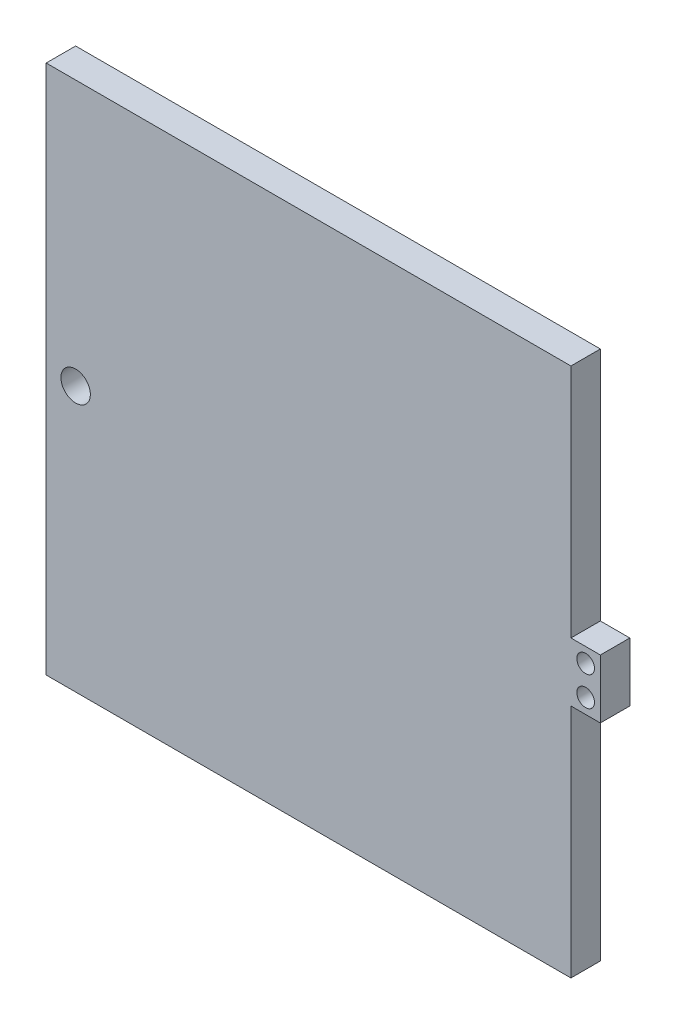
ISO-10303-21;
HEADER;
FILE_DESCRIPTION(('STEP AP214'),'2;1');
FILE_NAME('part.step','',(''),(''),'','','');
FILE_SCHEMA(('AUTOMOTIVE_DESIGN { 1 0 10303 214 1 1 1 1 }'));
ENDSEC;
DATA;
#1=APPLICATION_CONTEXT('core data for automotive mechanical design processes');
#2=APPLICATION_PROTOCOL_DEFINITION('international standard','automotive_design',2000,#1);
#3=PRODUCT_CONTEXT('',#1,'mechanical');
#4=PRODUCT('Part','Part','',(#3));
#5=PRODUCT_RELATED_PRODUCT_CATEGORY('part','',(#4));
#6=PRODUCT_DEFINITION_FORMATION('','',#4);
#7=PRODUCT_DEFINITION_CONTEXT('part definition',#1,'design');
#8=PRODUCT_DEFINITION('design','',#6,#7);
#9=PRODUCT_DEFINITION_SHAPE('','',#8);
#10=(LENGTH_UNIT() NAMED_UNIT(*) SI_UNIT(.MILLI.,.METRE.));
#11=(NAMED_UNIT(*) PLANE_ANGLE_UNIT() SI_UNIT($,.RADIAN.));
#12=(NAMED_UNIT(*) SI_UNIT($,.STERADIAN.) SOLID_ANGLE_UNIT());
#13=UNCERTAINTY_MEASURE_WITH_UNIT(LENGTH_MEASURE(1.E-05),#10,'distance_accuracy_value','');
#14=(GEOMETRIC_REPRESENTATION_CONTEXT(3) GLOBAL_UNCERTAINTY_ASSIGNED_CONTEXT((#13)) GLOBAL_UNIT_ASSIGNED_CONTEXT((#10,
#11,#12)) REPRESENTATION_CONTEXT('',''));
#15=CARTESIAN_POINT('',(0.,0.,0.));
#16=DIRECTION('',(0.,0.,1.));
#17=DIRECTION('',(1.,0.,0.));
#18=AXIS2_PLACEMENT_3D('',#15,#16,#17);
#19=CARTESIAN_POINT('',(103.892438209087,87.1772870662461,12.7));
#20=DIRECTION('',(-1.,0.,0.));
#21=DIRECTION('',(0.,-1.,0.));
#22=AXIS2_PLACEMENT_3D('',#19,#20,#21);
#23=PLANE('',#22);
#24=DIRECTION('',(0.,0.,1.));
#25=VECTOR('',#24,1.);
#26=CARTESIAN_POINT('',(103.892438209087,-1.72271293375393,12.7));
#27=LINE('',#26,#25);
#28=CARTESIAN_POINT('',(103.892438209087,-1.72271293375392,0.));
#29=VERTEX_POINT('',#28);
#30=CARTESIAN_POINT('',(103.892438209087,-1.72271293375392,12.7));
#31=VERTEX_POINT('',#30);
#32=EDGE_CURVE('E155',#29,#31,#27,.T.);
#33=ORIENTED_EDGE('',*,*,#32,.F.);
#34=DIRECTION('',(0.,1.,0.));
#35=VECTOR('',#34,1.);
#36=CARTESIAN_POINT('',(103.892438209087,87.1772870662461,0.));
#37=LINE('',#36,#35);
#38=CARTESIAN_POINT('',(103.892438209087,99.8772870662461,0.));
#39=VERTEX_POINT('',#38);
#40=EDGE_CURVE('E181',#29,#39,#37,.T.);
#41=ORIENTED_EDGE('',*,*,#40,.T.);
#42=DIRECTION('',(0.,0.,-1.));
#43=VECTOR('',#42,1.);
#44=CARTESIAN_POINT('',(103.892438209087,99.8772870662461,0.));
#45=LINE('',#44,#43);
#46=CARTESIAN_POINT('',(103.892438209087,99.8772870662461,12.7));
#47=VERTEX_POINT('',#46);
#48=EDGE_CURVE('E123',#47,#39,#45,.T.);
#49=ORIENTED_EDGE('',*,*,#48,.F.);
#50=DIRECTION('',(0.,1.,0.));
#51=VECTOR('',#50,1.);
#52=CARTESIAN_POINT('',(103.892438209087,87.1772870662461,12.7));
#53=LINE('',#52,#51);
#54=EDGE_CURVE('E56',#31,#47,#53,.T.);
#55=ORIENTED_EDGE('',*,*,#54,.F.);
#56=EDGE_LOOP('',(#33,#41,#49,#55));
#57=FACE_BOUND('',#56,.T.);
#58=ADVANCED_FACE('F41',(#57),#23,.F.);
#59=DIRECTION('',(0.,0.,-1.));
#60=VECTOR('',#59,1.);
#61=CARTESIAN_POINT('',(103.892438209087,-27.1227129337539,12.7));
#62=LINE('',#61,#60);
#63=CARTESIAN_POINT('',(103.892438209087,-27.1227129337539,12.7));
#64=VERTEX_POINT('',#63);
#65=CARTESIAN_POINT('',(103.892438209087,-27.1227129337539,0.));
#66=VERTEX_POINT('',#65);
#67=EDGE_CURVE('E64',#64,#66,#62,.T.);
#68=ORIENTED_EDGE('',*,*,#67,.F.);
#69=CARTESIAN_POINT('',(103.892438209087,-128.722712933754,12.7));
#70=VERTEX_POINT('',#69);
#71=EDGE_CURVE('E176',#70,#64,#53,.T.);
#72=ORIENTED_EDGE('',*,*,#71,.F.);
#73=DIRECTION('',(0.,0.,-1.));
#74=VECTOR('',#73,1.);
#75=CARTESIAN_POINT('',(103.892438209087,-128.722712933754,12.7));
#76=LINE('',#75,#74);
#77=CARTESIAN_POINT('',(103.892438209087,-128.722712933754,0.));
#78=VERTEX_POINT('',#77);
#79=EDGE_CURVE('E49',#70,#78,#76,.T.);
#80=ORIENTED_EDGE('',*,*,#79,.T.);
#81=EDGE_CURVE('E115',#78,#66,#37,.T.);
#82=ORIENTED_EDGE('',*,*,#81,.T.);
#83=EDGE_LOOP('',(#68,#72,#80,#82));
#84=FACE_BOUND('',#83,.T.);
#85=ADVANCED_FACE('F185',(#84),#23,.F.);
#86=CARTESIAN_POINT('',(-122.421561790913,87.1772870662461,12.7));
#87=DIRECTION('',(1.,0.,0.));
#88=DIRECTION('',(0.,1.,0.));
#89=AXIS2_PLACEMENT_3D('',#86,#87,#88);
#90=PLANE('',#89);
#91=DIRECTION('',(0.,-1.,0.));
#92=VECTOR('',#91,1.);
#93=CARTESIAN_POINT('',(-122.421561790913,87.1772870662461,0.));
#94=LINE('',#93,#92);
#95=CARTESIAN_POINT('',(-122.421561790913,99.8772870662461,0.));
#96=VERTEX_POINT('',#95);
#97=CARTESIAN_POINT('',(-122.421561790913,-128.722712933754,0.));
#98=VERTEX_POINT('',#97);
#99=EDGE_CURVE('E173',#96,#98,#94,.T.);
#100=ORIENTED_EDGE('',*,*,#99,.T.);
#101=DIRECTION('',(0.,0.,-1.));
#102=VECTOR('',#101,1.);
#103=CARTESIAN_POINT('',(-122.421561790913,-128.722712933754,12.7));
#104=LINE('',#103,#102);
#105=CARTESIAN_POINT('',(-122.421561790913,-128.722712933754,12.7));
#106=VERTEX_POINT('',#105);
#107=EDGE_CURVE('E11',#106,#98,#104,.T.);
#108=ORIENTED_EDGE('',*,*,#107,.F.);
#109=DIRECTION('',(0.,-1.,0.));
#110=VECTOR('',#109,1.);
#111=CARTESIAN_POINT('',(-122.421561790913,87.1772870662461,12.7));
#112=LINE('',#111,#110);
#113=CARTESIAN_POINT('',(-122.421561790913,99.8772870662461,12.7));
#114=VERTEX_POINT('',#113);
#115=EDGE_CURVE('E108',#114,#106,#112,.T.);
#116=ORIENTED_EDGE('',*,*,#115,.F.);
#117=DIRECTION('',(0.,0.,1.));
#118=VECTOR('',#117,1.);
#119=CARTESIAN_POINT('',(-122.421561790913,99.8772870662461,0.));
#120=LINE('',#119,#118);
#121=EDGE_CURVE('E112',#96,#114,#120,.T.);
#122=ORIENTED_EDGE('',*,*,#121,.F.);
#123=EDGE_LOOP('',(#100,#108,#116,#122));
#124=FACE_BOUND('',#123,.T.);
#125=ADVANCED_FACE('F43',(#124),#90,.F.);
#126=CARTESIAN_POINT('',(-122.421561790913,-128.722712933754,12.7));
#127=DIRECTION('',(0.,1.,0.));
#128=DIRECTION('',(0.,0.,1.));
#129=AXIS2_PLACEMENT_3D('',#126,#127,#128);
#130=PLANE('',#129);
#131=DIRECTION('',(1.,0.,0.));
#132=VECTOR('',#131,1.);
#133=CARTESIAN_POINT('',(-122.421561790913,-128.722712933754,0.));
#134=LINE('',#133,#132);
#135=EDGE_CURVE('E179',#98,#78,#134,.T.);
#136=ORIENTED_EDGE('',*,*,#135,.T.);
#137=ORIENTED_EDGE('',*,*,#79,.F.);
#138=DIRECTION('',(1.,0.,0.));
#139=VECTOR('',#138,1.);
#140=CARTESIAN_POINT('',(-122.421561790913,-128.722712933754,12.7));
#141=LINE('',#140,#139);
#142=EDGE_CURVE('E114',#106,#70,#141,.T.);
#143=ORIENTED_EDGE('',*,*,#142,.F.);
#144=ORIENTED_EDGE('',*,*,#107,.T.);
#145=EDGE_LOOP('',(#136,#137,#143,#144));
#146=FACE_BOUND('',#145,.T.);
#147=ADVANCED_FACE('F196',(#146),#130,.F.);
#148=CARTESIAN_POINT('',(0.,0.,12.7));
#149=DIRECTION('',(0.,0.,1.));
#150=DIRECTION('',(1.,0.,0.));
#151=AXIS2_PLACEMENT_3D('',#148,#149,#150);
#152=PLANE('',#151);
#153=CARTESIAN_POINT('',(-109.721561790913,-14.4227129337539,12.7));
#154=DIRECTION('',(0.,0.,-1.));
#155=DIRECTION('',(-1.,0.,0.));
#156=AXIS2_PLACEMENT_3D('',#153,#154,#155);
#157=CIRCLE('',#156,6.35);
#158=CARTESIAN_POINT('',(-116.071561790913,-14.4227129337539,12.7));
#159=VERTEX_POINT('',#158);
#160=EDGE_CURVE('E134',#159,#159,#157,.T.);
#161=ORIENTED_EDGE('',*,*,#160,.T.);
#162=EDGE_LOOP('',(#161));
#163=FACE_BOUND('',#162,.T.);
#164=CARTESIAN_POINT('',(110.242438209087,-8.07271293375392,12.7));
#165=DIRECTION('',(0.,0.,-1.));
#166=DIRECTION('',(-1.,0.,0.));
#167=AXIS2_PLACEMENT_3D('',#164,#165,#166);
#168=CIRCLE('',#167,3.81000000000001);
#169=CARTESIAN_POINT('',(106.432438209087,-8.07271293375392,12.7));
#170=VERTEX_POINT('',#169);
#171=EDGE_CURVE('E143',#170,#170,#168,.T.);
#172=ORIENTED_EDGE('',*,*,#171,.T.);
#173=EDGE_LOOP('',(#172));
#174=FACE_BOUND('',#173,.T.);
#175=CARTESIAN_POINT('',(110.242438209087,-20.7727129337539,12.7));
#176=DIRECTION('',(0.,0.,-1.));
#177=DIRECTION('',(-1.,0.,0.));
#178=AXIS2_PLACEMENT_3D('',#175,#176,#177);
#179=CIRCLE('',#178,3.81000000000001);
#180=CARTESIAN_POINT('',(106.432438209087,-20.7727129337539,12.7));
#181=VERTEX_POINT('',#180);
#182=EDGE_CURVE('E133',#181,#181,#179,.T.);
#183=ORIENTED_EDGE('',*,*,#182,.T.);
#184=EDGE_LOOP('',(#183));
#185=FACE_BOUND('',#184,.T.);
#186=ORIENTED_EDGE('',*,*,#115,.T.);
#187=ORIENTED_EDGE('',*,*,#142,.T.);
#188=ORIENTED_EDGE('',*,*,#71,.T.);
#189=DIRECTION('',(-1.,0.,0.));
#190=VECTOR('',#189,1.);
#191=CARTESIAN_POINT('',(116.592438209087,-27.1227129337539,12.7));
#192=LINE('',#191,#190);
#193=CARTESIAN_POINT('',(116.592438209087,-27.1227129337539,12.7));
#194=VERTEX_POINT('',#193);
#195=EDGE_CURVE('E171',#194,#64,#192,.T.);
#196=ORIENTED_EDGE('',*,*,#195,.F.);
#197=DIRECTION('',(0.,-1.,0.));
#198=VECTOR('',#197,1.);
#199=CARTESIAN_POINT('',(116.592438209087,-1.72271293375393,12.7));
#200=LINE('',#199,#198);
#201=CARTESIAN_POINT('',(116.592438209087,-1.72271293375393,12.7));
#202=VERTEX_POINT('',#201);
#203=EDGE_CURVE('E151',#202,#194,#200,.T.);
#204=ORIENTED_EDGE('',*,*,#203,.F.);
#205=DIRECTION('',(-1.,0.,0.));
#206=VECTOR('',#205,1.);
#207=CARTESIAN_POINT('',(116.592438209087,-1.72271293375393,12.7));
#208=LINE('',#207,#206);
#209=EDGE_CURVE('E161',#202,#31,#208,.T.);
#210=ORIENTED_EDGE('',*,*,#209,.T.);
#211=ORIENTED_EDGE('',*,*,#54,.T.);
#212=DIRECTION('',(1.,0.,0.));
#213=VECTOR('',#212,1.);
#214=CARTESIAN_POINT('',(-122.421561790913,99.8772870662461,12.7));
#215=LINE('',#214,#213);
#216=EDGE_CURVE('E118',#114,#47,#215,.T.);
#217=ORIENTED_EDGE('',*,*,#216,.F.);
#218=EDGE_LOOP('',(#186,#187,#188,#196,#204,#210,#211,#217));
#219=FACE_BOUND('',#218,.T.);
#220=ADVANCED_FACE('F119',(#163,#174,#185,#219),#152,.T.);
#221=CARTESIAN_POINT('',(0.,0.,0.));
#222=DIRECTION('',(0.,0.,1.));
#223=DIRECTION('',(1.,0.,0.));
#224=AXIS2_PLACEMENT_3D('',#221,#222,#223);
#225=PLANE('',#224);
#226=CARTESIAN_POINT('',(-109.721561790913,-14.4227129337539,0.));
#227=DIRECTION('',(0.,0.,-1.));
#228=DIRECTION('',(-1.,0.,0.));
#229=AXIS2_PLACEMENT_3D('',#226,#227,#228);
#230=CIRCLE('',#229,6.35);
#231=CARTESIAN_POINT('',(-116.071561790913,-14.4227129337539,0.));
#232=VERTEX_POINT('',#231);
#233=EDGE_CURVE('E137',#232,#232,#230,.T.);
#234=ORIENTED_EDGE('',*,*,#233,.F.);
#235=EDGE_LOOP('',(#234));
#236=FACE_BOUND('',#235,.T.);
#237=CARTESIAN_POINT('',(110.242438209087,-8.07271293375392,0.));
#238=DIRECTION('',(0.,0.,-1.));
#239=DIRECTION('',(-1.,0.,0.));
#240=AXIS2_PLACEMENT_3D('',#237,#238,#239);
#241=CIRCLE('',#240,3.81000000000001);
#242=CARTESIAN_POINT('',(106.432438209087,-8.07271293375392,0.));
#243=VERTEX_POINT('',#242);
#244=EDGE_CURVE('E140',#243,#243,#241,.T.);
#245=ORIENTED_EDGE('',*,*,#244,.F.);
#246=EDGE_LOOP('',(#245));
#247=FACE_BOUND('',#246,.T.);
#248=CARTESIAN_POINT('',(110.242438209087,-20.7727129337539,0.));
#249=DIRECTION('',(0.,0.,-1.));
#250=DIRECTION('',(-1.,0.,0.));
#251=AXIS2_PLACEMENT_3D('',#248,#249,#250);
#252=CIRCLE('',#251,3.81000000000001);
#253=CARTESIAN_POINT('',(106.432438209087,-20.7727129337539,0.));
#254=VERTEX_POINT('',#253);
#255=EDGE_CURVE('E146',#254,#254,#252,.T.);
#256=ORIENTED_EDGE('',*,*,#255,.F.);
#257=EDGE_LOOP('',(#256));
#258=FACE_BOUND('',#257,.T.);
#259=ORIENTED_EDGE('',*,*,#99,.F.);
#260=DIRECTION('',(-1.,0.,0.));
#261=VECTOR('',#260,1.);
#262=CARTESIAN_POINT('',(-122.421561790913,99.8772870662461,0.));
#263=LINE('',#262,#261);
#264=EDGE_CURVE('E128',#39,#96,#263,.T.);
#265=ORIENTED_EDGE('',*,*,#264,.F.);
#266=ORIENTED_EDGE('',*,*,#40,.F.);
#267=DIRECTION('',(-1.,0.,0.));
#268=VECTOR('',#267,1.);
#269=CARTESIAN_POINT('',(116.592438209087,-1.72271293375392,0.));
#270=LINE('',#269,#268);
#271=CARTESIAN_POINT('',(116.592438209087,-1.72271293375392,0.));
#272=VERTEX_POINT('',#271);
#273=EDGE_CURVE('E165',#272,#29,#270,.T.);
#274=ORIENTED_EDGE('',*,*,#273,.F.);
#275=DIRECTION('',(0.,1.,0.));
#276=VECTOR('',#275,1.);
#277=CARTESIAN_POINT('',(116.592438209087,-1.72271293375392,0.));
#278=LINE('',#277,#276);
#279=CARTESIAN_POINT('',(116.592438209087,-27.1227129337539,0.));
#280=VERTEX_POINT('',#279);
#281=EDGE_CURVE('E157',#280,#272,#278,.T.);
#282=ORIENTED_EDGE('',*,*,#281,.F.);
#283=DIRECTION('',(-1.,0.,0.));
#284=VECTOR('',#283,1.);
#285=CARTESIAN_POINT('',(116.592438209087,-27.1227129337539,0.));
#286=LINE('',#285,#284);
#287=EDGE_CURVE('E168',#280,#66,#286,.T.);
#288=ORIENTED_EDGE('',*,*,#287,.T.);
#289=ORIENTED_EDGE('',*,*,#81,.F.);
#290=ORIENTED_EDGE('',*,*,#135,.F.);
#291=EDGE_LOOP('',(#259,#265,#266,#274,#282,#288,#289,#290));
#292=FACE_BOUND('',#291,.T.);
#293=ADVANCED_FACE('F188',(#236,#247,#258,#292),#225,.F.);
#294=CARTESIAN_POINT('',(116.592438209087,-27.1227129337539,12.7));
#295=DIRECTION('',(0.,1.,0.));
#296=DIRECTION('',(0.,0.,1.));
#297=AXIS2_PLACEMENT_3D('',#294,#295,#296);
#298=PLANE('',#297);
#299=ORIENTED_EDGE('',*,*,#67,.T.);
#300=ORIENTED_EDGE('',*,*,#287,.F.);
#301=DIRECTION('',(0.,0.,-1.));
#302=VECTOR('',#301,1.);
#303=CARTESIAN_POINT('',(116.592438209087,-27.1227129337539,12.7));
#304=LINE('',#303,#302);
#305=EDGE_CURVE('E154',#194,#280,#304,.T.);
#306=ORIENTED_EDGE('',*,*,#305,.F.);
#307=ORIENTED_EDGE('',*,*,#195,.T.);
#308=EDGE_LOOP('',(#299,#300,#306,#307));
#309=FACE_BOUND('',#308,.T.);
#310=ADVANCED_FACE('F193',(#309),#298,.F.);
#311=CARTESIAN_POINT('',(116.592438209087,-1.72271293375393,12.7));
#312=DIRECTION('',(0.,-1.,0.));
#313=DIRECTION('',(0.,0.,-1.));
#314=AXIS2_PLACEMENT_3D('',#311,#312,#313);
#315=PLANE('',#314);
#316=ORIENTED_EDGE('',*,*,#32,.T.);
#317=ORIENTED_EDGE('',*,*,#209,.F.);
#318=DIRECTION('',(0.,0.,1.));
#319=VECTOR('',#318,1.);
#320=CARTESIAN_POINT('',(116.592438209087,-1.72271293375393,12.7));
#321=LINE('',#320,#319);
#322=EDGE_CURVE('E159',#272,#202,#321,.T.);
#323=ORIENTED_EDGE('',*,*,#322,.F.);
#324=ORIENTED_EDGE('',*,*,#273,.T.);
#325=EDGE_LOOP('',(#316,#317,#323,#324));
#326=FACE_BOUND('',#325,.T.);
#327=ADVANCED_FACE('F200',(#326),#315,.F.);
#328=CARTESIAN_POINT('',(116.592438209087,0.,0.));
#329=DIRECTION('',(1.,0.,0.));
#330=DIRECTION('',(0.,0.,-1.));
#331=AXIS2_PLACEMENT_3D('',#328,#329,#330);
#332=PLANE('',#331);
#333=ORIENTED_EDGE('',*,*,#203,.T.);
#334=ORIENTED_EDGE('',*,*,#305,.T.);
#335=ORIENTED_EDGE('',*,*,#281,.T.);
#336=ORIENTED_EDGE('',*,*,#322,.T.);
#337=EDGE_LOOP('',(#333,#334,#335,#336));
#338=FACE_BOUND('',#337,.T.);
#339=ADVANCED_FACE('F203',(#338),#332,.T.);
#340=CARTESIAN_POINT('',(110.242438209087,-20.7727129337539,12.7));
#341=DIRECTION('',(0.,0.,-1.));
#342=DIRECTION('',(-1.,0.,0.));
#343=AXIS2_PLACEMENT_3D('',#340,#341,#342);
#344=CYLINDRICAL_SURFACE('',#343,3.81000000000001);
#345=ORIENTED_EDGE('',*,*,#182,.F.);
#346=EDGE_LOOP('',(#345));
#347=FACE_BOUND('',#346,.T.);
#348=ORIENTED_EDGE('',*,*,#255,.T.);
#349=EDGE_LOOP('',(#348));
#350=FACE_BOUND('',#349,.T.);
#351=ADVANCED_FACE('F205',(#347,#350),#344,.F.);
#352=CARTESIAN_POINT('',(110.242438209087,-8.07271293375392,12.7));
#353=DIRECTION('',(0.,0.,-1.));
#354=DIRECTION('',(-1.,0.,0.));
#355=AXIS2_PLACEMENT_3D('',#352,#353,#354);
#356=CYLINDRICAL_SURFACE('',#355,3.81000000000001);
#357=ORIENTED_EDGE('',*,*,#171,.F.);
#358=EDGE_LOOP('',(#357));
#359=FACE_BOUND('',#358,.T.);
#360=ORIENTED_EDGE('',*,*,#244,.T.);
#361=EDGE_LOOP('',(#360));
#362=FACE_BOUND('',#361,.T.);
#363=ADVANCED_FACE('F211',(#359,#362),#356,.F.);
#364=CARTESIAN_POINT('',(-109.721561790913,-14.4227129337539,12.7));
#365=DIRECTION('',(0.,0.,-1.));
#366=DIRECTION('',(-1.,0.,0.));
#367=AXIS2_PLACEMENT_3D('',#364,#365,#366);
#368=CYLINDRICAL_SURFACE('',#367,6.35);
#369=ORIENTED_EDGE('',*,*,#160,.F.);
#370=EDGE_LOOP('',(#369));
#371=FACE_BOUND('',#370,.T.);
#372=ORIENTED_EDGE('',*,*,#233,.T.);
#373=EDGE_LOOP('',(#372));
#374=FACE_BOUND('',#373,.T.);
#375=ADVANCED_FACE('F249',(#371,#374),#368,.F.);
#376=CARTESIAN_POINT('',(0.,99.8772870662461,0.));
#377=DIRECTION('',(0.,1.,0.));
#378=DIRECTION('',(0.,0.,1.));
#379=AXIS2_PLACEMENT_3D('',#376,#377,#378);
#380=PLANE('',#379);
#381=ORIENTED_EDGE('',*,*,#121,.T.);
#382=ORIENTED_EDGE('',*,*,#216,.T.);
#383=ORIENTED_EDGE('',*,*,#48,.T.);
#384=ORIENTED_EDGE('',*,*,#264,.T.);
#385=EDGE_LOOP('',(#381,#382,#383,#384));
#386=FACE_BOUND('',#385,.T.);
#387=ADVANCED_FACE('F126',(#386),#380,.T.);
#388=CLOSED_SHELL('',(#58,#85,#125,#147,#220,#293,#310,#327,#339,#351,#363,#375,#387));
#389=MANIFOLD_SOLID_BREP('B2',#388);
#390=ADVANCED_BREP_SHAPE_REPRESENTATION('',(#18,#389),#14);
#391=SHAPE_DEFINITION_REPRESENTATION(#9,#390);
ENDSEC;
END-ISO-10303-21;
